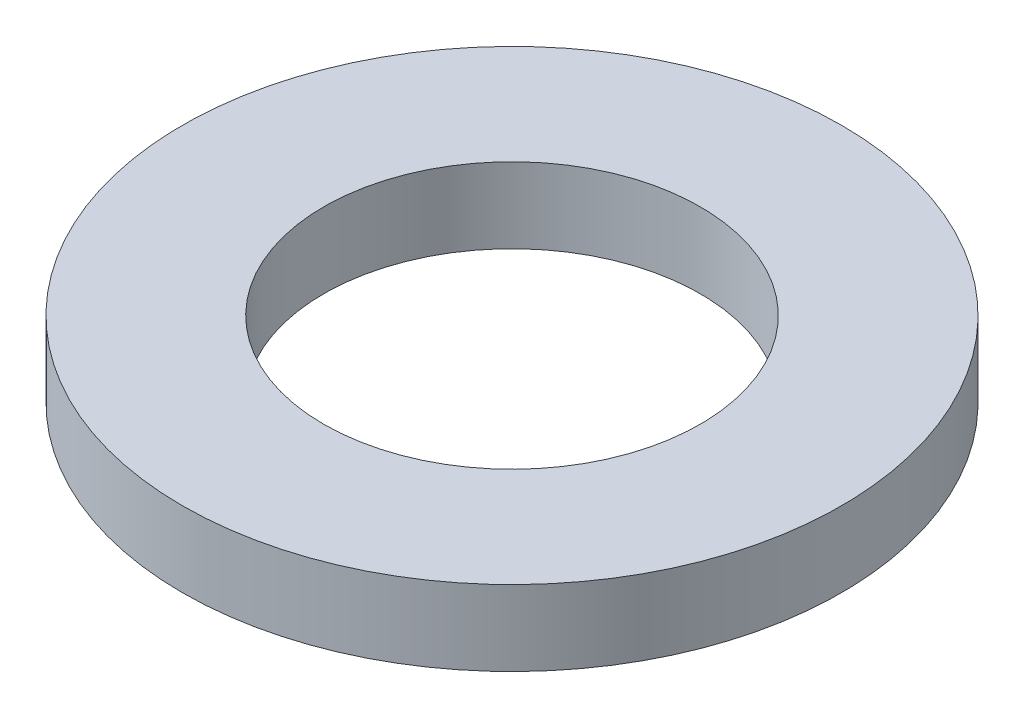
ISO-10303-21;
HEADER;
FILE_DESCRIPTION(('STEP AP214'),'2;1');
FILE_NAME('part.step','',(''),(''),'','','');
FILE_SCHEMA(('AUTOMOTIVE_DESIGN { 1 0 10303 214 1 1 1 1 }'));
ENDSEC;
DATA;
#1=APPLICATION_CONTEXT('core data for automotive mechanical design processes');
#2=APPLICATION_PROTOCOL_DEFINITION('international standard','automotive_design',2000,#1);
#3=PRODUCT_CONTEXT('',#1,'mechanical');
#4=PRODUCT('Part','Part','',(#3));
#5=PRODUCT_RELATED_PRODUCT_CATEGORY('part','',(#4));
#6=PRODUCT_DEFINITION_FORMATION('','',#4);
#7=PRODUCT_DEFINITION_CONTEXT('part definition',#1,'design');
#8=PRODUCT_DEFINITION('design','',#6,#7);
#9=PRODUCT_DEFINITION_SHAPE('','',#8);
#10=(LENGTH_UNIT() NAMED_UNIT(*) SI_UNIT(.MILLI.,.METRE.));
#11=(NAMED_UNIT(*) PLANE_ANGLE_UNIT() SI_UNIT($,.RADIAN.));
#12=(NAMED_UNIT(*) SI_UNIT($,.STERADIAN.) SOLID_ANGLE_UNIT());
#13=UNCERTAINTY_MEASURE_WITH_UNIT(LENGTH_MEASURE(1.E-05),#10,'distance_accuracy_value','');
#14=(GEOMETRIC_REPRESENTATION_CONTEXT(3) GLOBAL_UNCERTAINTY_ASSIGNED_CONTEXT((#13)) GLOBAL_UNIT_ASSIGNED_CONTEXT((#10,
#11,#12)) REPRESENTATION_CONTEXT('',''));
#15=CARTESIAN_POINT('',(0.,0.,0.));
#16=DIRECTION('',(0.,0.,1.));
#17=DIRECTION('',(1.,0.,0.));
#18=AXIS2_PLACEMENT_3D('',#15,#16,#17);
#19=CARTESIAN_POINT('',(0.,4.,0.));
#20=DIRECTION('',(0.,-1.,0.));
#21=DIRECTION('',(0.,0.,-1.));
#22=AXIS2_PLACEMENT_3D('',#19,#20,#21);
#23=CYLINDRICAL_SURFACE('',#22,17.5);
#24=CARTESIAN_POINT('',(0.,4.,0.));
#25=DIRECTION('',(0.,1.,0.));
#26=DIRECTION('',(0.,0.,1.));
#27=AXIS2_PLACEMENT_3D('',#24,#25,#26);
#28=CIRCLE('',#27,17.5);
#29=CARTESIAN_POINT('',(0.,4.,17.5));
#30=VERTEX_POINT('',#29);
#31=EDGE_CURVE('E10',#30,#30,#28,.T.);
#32=ORIENTED_EDGE('',*,*,#31,.F.);
#33=EDGE_LOOP('',(#32));
#34=FACE_BOUND('',#33,.T.);
#35=CARTESIAN_POINT('',(0.,0.,0.));
#36=DIRECTION('',(0.,1.,0.));
#37=DIRECTION('',(0.,0.,1.));
#38=AXIS2_PLACEMENT_3D('',#35,#36,#37);
#39=CIRCLE('',#38,17.5);
#40=CARTESIAN_POINT('',(0.,0.,17.5));
#41=VERTEX_POINT('',#40);
#42=EDGE_CURVE('E37',#41,#41,#39,.T.);
#43=ORIENTED_EDGE('',*,*,#42,.T.);
#44=EDGE_LOOP('',(#43));
#45=FACE_BOUND('',#44,.T.);
#46=ADVANCED_FACE('F40',(#34,#45),#23,.T.);
#47=CARTESIAN_POINT('',(0.,4.,0.));
#48=DIRECTION('',(0.,1.,0.));
#49=DIRECTION('',(0.,0.,1.));
#50=AXIS2_PLACEMENT_3D('',#47,#48,#49);
#51=PLANE('',#50);
#52=CARTESIAN_POINT('',(0.,4.,0.));
#53=DIRECTION('',(0.,1.,0.));
#54=DIRECTION('',(0.,0.,1.));
#55=AXIS2_PLACEMENT_3D('',#52,#53,#54);
#56=CIRCLE('',#55,10.);
#57=CARTESIAN_POINT('',(0.,4.,10.));
#58=VERTEX_POINT('',#57);
#59=EDGE_CURVE('E50',#58,#58,#56,.T.);
#60=ORIENTED_EDGE('',*,*,#59,.F.);
#61=EDGE_LOOP('',(#60));
#62=FACE_BOUND('',#61,.T.);
#63=ORIENTED_EDGE('',*,*,#31,.T.);
#64=EDGE_LOOP('',(#63));
#65=FACE_BOUND('',#64,.T.);
#66=ADVANCED_FACE('F59',(#62,#65),#51,.T.);
#67=CARTESIAN_POINT('',(0.,0.,0.));
#68=DIRECTION('',(0.,1.,0.));
#69=DIRECTION('',(0.,0.,1.));
#70=AXIS2_PLACEMENT_3D('',#67,#68,#69);
#71=PLANE('',#70);
#72=CARTESIAN_POINT('',(0.,0.,0.));
#73=DIRECTION('',(0.,1.,0.));
#74=DIRECTION('',(0.,0.,1.));
#75=AXIS2_PLACEMENT_3D('',#72,#73,#74);
#76=CIRCLE('',#75,10.);
#77=CARTESIAN_POINT('',(0.,0.,10.));
#78=VERTEX_POINT('',#77);
#79=EDGE_CURVE('E47',#78,#78,#76,.T.);
#80=ORIENTED_EDGE('',*,*,#79,.T.);
#81=EDGE_LOOP('',(#80));
#82=FACE_BOUND('',#81,.T.);
#83=ORIENTED_EDGE('',*,*,#42,.F.);
#84=EDGE_LOOP('',(#83));
#85=FACE_BOUND('',#84,.T.);
#86=ADVANCED_FACE('F58',(#82,#85),#71,.F.);
#87=CARTESIAN_POINT('',(0.,4.,0.));
#88=DIRECTION('',(0.,-1.,0.));
#89=DIRECTION('',(0.,0.,-1.));
#90=AXIS2_PLACEMENT_3D('',#87,#88,#89);
#91=CYLINDRICAL_SURFACE('',#90,10.);
#92=ORIENTED_EDGE('',*,*,#59,.T.);
#93=EDGE_LOOP('',(#92));
#94=FACE_BOUND('',#93,.T.);
#95=ORIENTED_EDGE('',*,*,#79,.F.);
#96=EDGE_LOOP('',(#95));
#97=FACE_BOUND('',#96,.T.);
#98=ADVANCED_FACE('F54',(#94,#97),#91,.F.);
#99=CLOSED_SHELL('',(#46,#66,#86,#98));
#100=MANIFOLD_SOLID_BREP('B2',#99);
#101=ADVANCED_BREP_SHAPE_REPRESENTATION('',(#18,#100),#14);
#102=SHAPE_DEFINITION_REPRESENTATION(#9,#101);
ENDSEC;
END-ISO-10303-21;
